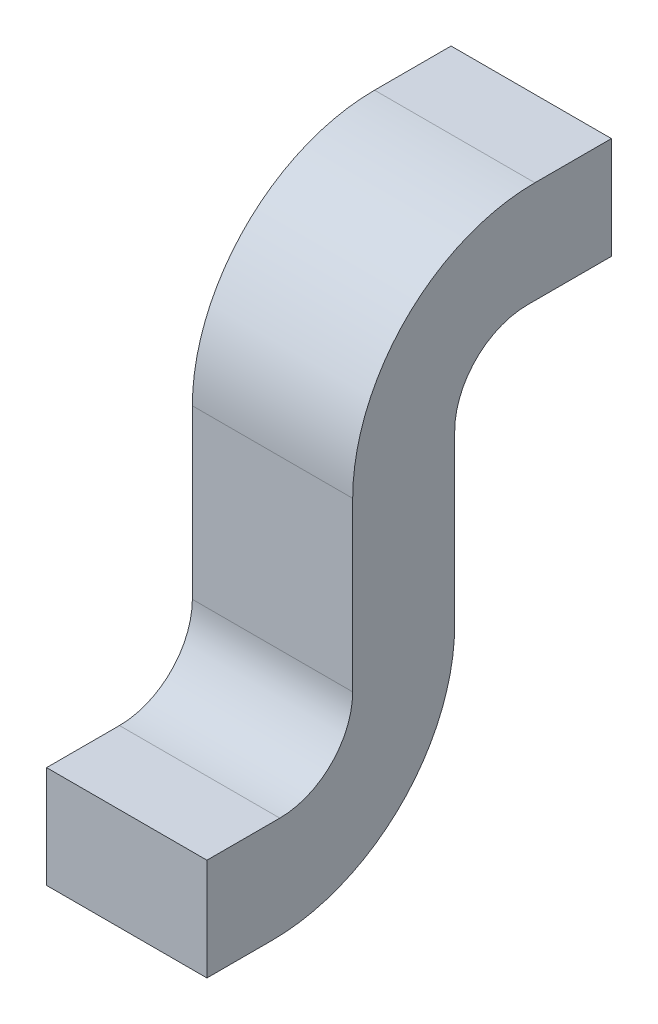
ISO-10303-21;
HEADER;
FILE_DESCRIPTION(('STEP AP214'),'2;1');
FILE_NAME('part.step','',(''),(''),'','','');
FILE_SCHEMA(('AUTOMOTIVE_DESIGN { 1 0 10303 214 1 1 1 1 }'));
ENDSEC;
DATA;
#1=APPLICATION_CONTEXT('core data for automotive mechanical design processes');
#2=APPLICATION_PROTOCOL_DEFINITION('international standard','automotive_design',2000,#1);
#3=PRODUCT_CONTEXT('',#1,'mechanical');
#4=PRODUCT('Part','Part','',(#3));
#5=PRODUCT_RELATED_PRODUCT_CATEGORY('part','',(#4));
#6=PRODUCT_DEFINITION_FORMATION('','',#4);
#7=PRODUCT_DEFINITION_CONTEXT('part definition',#1,'design');
#8=PRODUCT_DEFINITION('design','',#6,#7);
#9=PRODUCT_DEFINITION_SHAPE('','',#8);
#10=(LENGTH_UNIT() NAMED_UNIT(*) SI_UNIT(.MILLI.,.METRE.));
#11=(NAMED_UNIT(*) PLANE_ANGLE_UNIT() SI_UNIT($,.RADIAN.));
#12=(NAMED_UNIT(*) SI_UNIT($,.STERADIAN.) SOLID_ANGLE_UNIT());
#13=UNCERTAINTY_MEASURE_WITH_UNIT(LENGTH_MEASURE(1.E-05),#10,'distance_accuracy_value','');
#14=(GEOMETRIC_REPRESENTATION_CONTEXT(3) GLOBAL_UNCERTAINTY_ASSIGNED_CONTEXT((#13)) GLOBAL_UNIT_ASSIGNED_CONTEXT((#10,
#11,#12)) REPRESENTATION_CONTEXT('',''));
#15=CARTESIAN_POINT('',(0.,0.,0.));
#16=DIRECTION('',(0.,0.,1.));
#17=DIRECTION('',(1.,0.,0.));
#18=AXIS2_PLACEMENT_3D('',#15,#16,#17);
#19=CARTESIAN_POINT('',(0.11,0.165,0.545));
#20=DIRECTION('',(-1.,0.,0.));
#21=DIRECTION('',(0.,1.,0.));
#22=AXIS2_PLACEMENT_3D('',#19,#20,#21);
#23=PLANE('',#22);
#24=DIRECTION('',(0.,1.,0.));
#25=VECTOR('',#24,1.);
#26=CARTESIAN_POINT('',(0.11,0.165,1.1));
#27=LINE('',#26,#25);
#28=CARTESIAN_POINT('',(0.11,-0.485,1.1));
#29=VERTEX_POINT('',#28);
#30=CARTESIAN_POINT('',(0.11,-0.345,1.1));
#31=VERTEX_POINT('',#30);
#32=EDGE_CURVE('E215',#29,#31,#27,.T.);
#33=ORIENTED_EDGE('',*,*,#32,.F.);
#34=DIRECTION('',(0.,0.,1.));
#35=VECTOR('',#34,1.);
#36=CARTESIAN_POINT('',(0.11,-0.485,0.545));
#37=LINE('',#36,#35);
#38=CARTESIAN_POINT('',(0.11,-0.485,1.01));
#39=VERTEX_POINT('',#38);
#40=EDGE_CURVE('E189',#39,#29,#37,.T.);
#41=ORIENTED_EDGE('',*,*,#40,.F.);
#42=CARTESIAN_POINT('',(0.11,-0.235,1.01));
#43=DIRECTION('',(-1.,0.,0.));
#44=DIRECTION('',(0.,0.,1.));
#45=AXIS2_PLACEMENT_3D('',#42,#43,#44);
#46=CIRCLE('',#45,0.25);
#47=CARTESIAN_POINT('',(0.11,-0.235,0.76));
#48=VERTEX_POINT('',#47);
#49=EDGE_CURVE('E185',#48,#39,#46,.T.);
#50=ORIENTED_EDGE('',*,*,#49,.F.);
#51=DIRECTION('',(0.,-1.,0.));
#52=VECTOR('',#51,1.);
#53=CARTESIAN_POINT('',(0.11,0.165,0.76));
#54=LINE('',#53,#52);
#55=CARTESIAN_POINT('',(0.11,-0.004999999999999,0.76));
#56=VERTEX_POINT('',#55);
#57=EDGE_CURVE('E180',#56,#48,#54,.T.);
#58=ORIENTED_EDGE('',*,*,#57,.F.);
#59=CARTESIAN_POINT('',(0.11,-0.004999999999999,0.66));
#60=DIRECTION('',(1.,0.,0.));
#61=DIRECTION('',(0.,0.,1.));
#62=AXIS2_PLACEMENT_3D('',#59,#60,#61);
#63=CIRCLE('',#62,0.1);
#64=CARTESIAN_POINT('',(0.11,0.095,0.66));
#65=VERTEX_POINT('',#64);
#66=EDGE_CURVE('E142',#65,#56,#63,.T.);
#67=ORIENTED_EDGE('',*,*,#66,.F.);
#68=DIRECTION('',(0.,0.,1.));
#69=VECTOR('',#68,1.);
#70=CARTESIAN_POINT('',(0.11,0.095,0.545));
#71=LINE('',#70,#69);
#72=CARTESIAN_POINT('',(0.11,0.095,0.545));
#73=VERTEX_POINT('',#72);
#74=EDGE_CURVE('E138',#73,#65,#71,.T.);
#75=ORIENTED_EDGE('',*,*,#74,.F.);
#76=DIRECTION('',(0.,-1.,0.));
#77=VECTOR('',#76,1.);
#78=CARTESIAN_POINT('',(0.11,0.165,0.545));
#79=LINE('',#78,#77);
#80=CARTESIAN_POINT('',(0.11,0.235,0.545));
#81=VERTEX_POINT('',#80);
#82=EDGE_CURVE('E108',#81,#73,#79,.T.);
#83=ORIENTED_EDGE('',*,*,#82,.F.);
#84=DIRECTION('',(0.,0.,-1.));
#85=VECTOR('',#84,1.);
#86=CARTESIAN_POINT('',(0.11,0.235,0.545));
#87=LINE('',#86,#85);
#88=CARTESIAN_POINT('',(0.11,0.235,0.65));
#89=VERTEX_POINT('',#88);
#90=EDGE_CURVE('E99',#89,#81,#87,.T.);
#91=ORIENTED_EDGE('',*,*,#90,.F.);
#92=CARTESIAN_POINT('',(0.11,-0.015,0.65));
#93=DIRECTION('',(-1.,0.,0.));
#94=DIRECTION('',(0.,0.,1.));
#95=AXIS2_PLACEMENT_3D('',#92,#93,#94);
#96=CIRCLE('',#95,0.25);
#97=CARTESIAN_POINT('',(0.11,-0.015,0.9));
#98=VERTEX_POINT('',#97);
#99=EDGE_CURVE('E191',#98,#89,#96,.T.);
#100=ORIENTED_EDGE('',*,*,#99,.F.);
#101=DIRECTION('',(0.,1.,0.));
#102=VECTOR('',#101,1.);
#103=CARTESIAN_POINT('',(0.11,0.165,0.9));
#104=LINE('',#103,#102);
#105=CARTESIAN_POINT('',(0.11,-0.245,0.9));
#106=VERTEX_POINT('',#105);
#107=EDGE_CURVE('E205',#106,#98,#104,.T.);
#108=ORIENTED_EDGE('',*,*,#107,.F.);
#109=CARTESIAN_POINT('',(0.11,-0.245,1.));
#110=DIRECTION('',(1.,0.,0.));
#111=DIRECTION('',(0.,0.,1.));
#112=AXIS2_PLACEMENT_3D('',#109,#110,#111);
#113=CIRCLE('',#112,0.1);
#114=CARTESIAN_POINT('',(0.11,-0.345,1.));
#115=VERTEX_POINT('',#114);
#116=EDGE_CURVE('E172',#115,#106,#113,.T.);
#117=ORIENTED_EDGE('',*,*,#116,.F.);
#118=DIRECTION('',(0.,0.,-1.));
#119=VECTOR('',#118,1.);
#120=CARTESIAN_POINT('',(0.11,-0.345,0.545));
#121=LINE('',#120,#119);
#122=EDGE_CURVE('E11',#31,#115,#121,.T.);
#123=ORIENTED_EDGE('',*,*,#122,.F.);
#124=EDGE_LOOP('',(#33,#41,#50,#58,#67,#75,#83,#91,#100,#108,#117,#123));
#125=FACE_BOUND('',#124,.T.);
#126=ADVANCED_FACE('F16',(#125),#23,.F.);
#127=CARTESIAN_POINT('',(-0.11,-0.345,1.05));
#128=DIRECTION('',(0.,1.,0.));
#129=DIRECTION('',(0.,0.,-1.));
#130=AXIS2_PLACEMENT_3D('',#127,#128,#129);
#131=PLANE('',#130);
#132=DIRECTION('',(0.,0.,1.));
#133=VECTOR('',#132,1.);
#134=CARTESIAN_POINT('',(-0.11,-0.345,1.05));
#135=LINE('',#134,#133);
#136=CARTESIAN_POINT('',(-0.11,-0.345,1.));
#137=VERTEX_POINT('',#136);
#138=CARTESIAN_POINT('',(-0.11,-0.345,1.1));
#139=VERTEX_POINT('',#138);
#140=EDGE_CURVE('E20',#137,#139,#135,.T.);
#141=ORIENTED_EDGE('',*,*,#140,.T.);
#142=DIRECTION('',(1.,0.,0.));
#143=VECTOR('',#142,1.);
#144=CARTESIAN_POINT('',(-0.11,-0.345,1.1));
#145=LINE('',#144,#143);
#146=EDGE_CURVE('E27',#139,#31,#145,.T.);
#147=ORIENTED_EDGE('',*,*,#146,.T.);
#148=ORIENTED_EDGE('',*,*,#122,.T.);
#149=DIRECTION('',(-1.,0.,0.));
#150=VECTOR('',#149,1.);
#151=CARTESIAN_POINT('',(-0.11,-0.345,1.));
#152=LINE('',#151,#150);
#153=EDGE_CURVE('E176',#115,#137,#152,.T.);
#154=ORIENTED_EDGE('',*,*,#153,.T.);
#155=EDGE_LOOP('',(#141,#147,#148,#154));
#156=FACE_BOUND('',#155,.T.);
#157=ADVANCED_FACE('F429',(#156),#131,.T.);
#158=CARTESIAN_POINT('',(-0.11,-0.415,1.1));
#159=DIRECTION('',(0.,0.,1.));
#160=DIRECTION('',(1.,0.,0.));
#161=AXIS2_PLACEMENT_3D('',#158,#159,#160);
#162=PLANE('',#161);
#163=DIRECTION('',(0.,-1.,0.));
#164=VECTOR('',#163,1.);
#165=CARTESIAN_POINT('',(-0.11,-0.415,1.1));
#166=LINE('',#165,#164);
#167=CARTESIAN_POINT('',(-0.11,-0.485,1.1));
#168=VERTEX_POINT('',#167);
#169=EDGE_CURVE('E240',#139,#168,#166,.T.);
#170=ORIENTED_EDGE('',*,*,#169,.T.);
#171=DIRECTION('',(1.,0.,0.));
#172=VECTOR('',#171,1.);
#173=CARTESIAN_POINT('',(-0.11,-0.485,1.1));
#174=LINE('',#173,#172);
#175=EDGE_CURVE('E200',#168,#29,#174,.T.);
#176=ORIENTED_EDGE('',*,*,#175,.T.);
#177=ORIENTED_EDGE('',*,*,#32,.T.);
#178=ORIENTED_EDGE('',*,*,#146,.F.);
#179=EDGE_LOOP('',(#170,#176,#177,#178));
#180=FACE_BOUND('',#179,.T.);
#181=ADVANCED_FACE('F262',(#180),#162,.T.);
#182=CARTESIAN_POINT('',(-0.11,-0.485,1.055));
#183=DIRECTION('',(0.,-1.,0.));
#184=DIRECTION('',(0.,0.,-1.));
#185=AXIS2_PLACEMENT_3D('',#182,#183,#184);
#186=PLANE('',#185);
#187=DIRECTION('',(0.,0.,-1.));
#188=VECTOR('',#187,1.);
#189=CARTESIAN_POINT('',(-0.11,-0.485,1.055));
#190=LINE('',#189,#188);
#191=CARTESIAN_POINT('',(-0.11,-0.485,1.01));
#192=VERTEX_POINT('',#191);
#193=EDGE_CURVE('E236',#168,#192,#190,.T.);
#194=ORIENTED_EDGE('',*,*,#193,.T.);
#195=DIRECTION('',(1.,0.,0.));
#196=VECTOR('',#195,1.);
#197=CARTESIAN_POINT('',(-0.11,-0.485,1.01));
#198=LINE('',#197,#196);
#199=EDGE_CURVE('E190',#192,#39,#198,.T.);
#200=ORIENTED_EDGE('',*,*,#199,.T.);
#201=ORIENTED_EDGE('',*,*,#40,.T.);
#202=ORIENTED_EDGE('',*,*,#175,.F.);
#203=EDGE_LOOP('',(#194,#200,#201,#202));
#204=FACE_BOUND('',#203,.T.);
#205=ADVANCED_FACE('F268',(#204),#186,.T.);
#206=CARTESIAN_POINT('',(-0.11,-0.235,1.01));
#207=DIRECTION('',(-1.,0.,0.));
#208=DIRECTION('',(0.,0.,1.));
#209=AXIS2_PLACEMENT_3D('',#206,#207,#208);
#210=CYLINDRICAL_SURFACE('',#209,0.25);
#211=ORIENTED_EDGE('',*,*,#199,.F.);
#212=CARTESIAN_POINT('',(-0.11,-0.235,1.01));
#213=DIRECTION('',(1.,0.,0.));
#214=DIRECTION('',(0.,0.,1.));
#215=AXIS2_PLACEMENT_3D('',#212,#213,#214);
#216=CIRCLE('',#215,0.25);
#217=CARTESIAN_POINT('',(-0.11,-0.235,0.76));
#218=VERTEX_POINT('',#217);
#219=EDGE_CURVE('E241',#192,#218,#216,.T.);
#220=ORIENTED_EDGE('',*,*,#219,.T.);
#221=DIRECTION('',(1.,0.,0.));
#222=VECTOR('',#221,1.);
#223=CARTESIAN_POINT('',(-0.11,-0.235,0.76));
#224=LINE('',#223,#222);
#225=EDGE_CURVE('E183',#218,#48,#224,.T.);
#226=ORIENTED_EDGE('',*,*,#225,.T.);
#227=ORIENTED_EDGE('',*,*,#49,.T.);
#228=EDGE_LOOP('',(#211,#220,#226,#227));
#229=FACE_BOUND('',#228,.T.);
#230=ADVANCED_FACE('F18',(#229),#210,.T.);
#231=CARTESIAN_POINT('',(-0.11,-0.12,0.76));
#232=DIRECTION('',(0.,0.,-1.));
#233=DIRECTION('',(-1.,0.,0.));
#234=AXIS2_PLACEMENT_3D('',#231,#232,#233);
#235=PLANE('',#234);
#236=DIRECTION('',(0.,1.,0.));
#237=VECTOR('',#236,1.);
#238=CARTESIAN_POINT('',(-0.11,-0.12,0.76));
#239=LINE('',#238,#237);
#240=CARTESIAN_POINT('',(-0.11,-0.004999999999999,0.76));
#241=VERTEX_POINT('',#240);
#242=EDGE_CURVE('E153',#218,#241,#239,.T.);
#243=ORIENTED_EDGE('',*,*,#242,.T.);
#244=DIRECTION('',(1.,0.,0.));
#245=VECTOR('',#244,1.);
#246=CARTESIAN_POINT('',(-0.11,-0.004999999999998,0.76));
#247=LINE('',#246,#245);
#248=EDGE_CURVE('E148',#241,#56,#247,.T.);
#249=ORIENTED_EDGE('',*,*,#248,.T.);
#250=ORIENTED_EDGE('',*,*,#57,.T.);
#251=ORIENTED_EDGE('',*,*,#225,.F.);
#252=EDGE_LOOP('',(#243,#249,#250,#251));
#253=FACE_BOUND('',#252,.T.);
#254=ADVANCED_FACE('F503',(#253),#235,.T.);
#255=CARTESIAN_POINT('',(-0.11,-0.004999999999999,0.66));
#256=DIRECTION('',(-1.,0.,0.));
#257=DIRECTION('',(0.,0.,1.));
#258=AXIS2_PLACEMENT_3D('',#255,#256,#257);
#259=CYLINDRICAL_SURFACE('',#258,0.1);
#260=DIRECTION('',(-1.,0.,0.));
#261=VECTOR('',#260,1.);
#262=CARTESIAN_POINT('',(-0.11,0.095,0.66));
#263=LINE('',#262,#261);
#264=CARTESIAN_POINT('',(-0.11,0.095,0.66));
#265=VERTEX_POINT('',#264);
#266=EDGE_CURVE('E131',#65,#265,#263,.T.);
#267=ORIENTED_EDGE('',*,*,#266,.F.);
#268=ORIENTED_EDGE('',*,*,#66,.T.);
#269=ORIENTED_EDGE('',*,*,#248,.F.);
#270=CARTESIAN_POINT('',(-0.11,-0.004999999999999,0.66));
#271=DIRECTION('',(1.,0.,0.));
#272=DIRECTION('',(0.,0.,1.));
#273=AXIS2_PLACEMENT_3D('',#270,#271,#272);
#274=CIRCLE('',#273,0.1);
#275=EDGE_CURVE('E145',#265,#241,#274,.T.);
#276=ORIENTED_EDGE('',*,*,#275,.F.);
#277=EDGE_LOOP('',(#267,#268,#269,#276));
#278=FACE_BOUND('',#277,.T.);
#279=ADVANCED_FACE('F146',(#278),#259,.F.);
#280=CARTESIAN_POINT('',(-0.11,0.095,0.6025));
#281=DIRECTION('',(0.,-1.,0.));
#282=DIRECTION('',(0.,0.,-1.));
#283=AXIS2_PLACEMENT_3D('',#280,#281,#282);
#284=PLANE('',#283);
#285=DIRECTION('',(0.,0.,-1.));
#286=VECTOR('',#285,1.);
#287=CARTESIAN_POINT('',(-0.11,0.095,0.6025));
#288=LINE('',#287,#286);
#289=CARTESIAN_POINT('',(-0.11,0.095,0.545));
#290=VERTEX_POINT('',#289);
#291=EDGE_CURVE('E136',#265,#290,#288,.T.);
#292=ORIENTED_EDGE('',*,*,#291,.T.);
#293=DIRECTION('',(1.,0.,0.));
#294=VECTOR('',#293,1.);
#295=CARTESIAN_POINT('',(-0.11,0.095,0.545));
#296=LINE('',#295,#294);
#297=EDGE_CURVE('E170',#290,#73,#296,.T.);
#298=ORIENTED_EDGE('',*,*,#297,.T.);
#299=ORIENTED_EDGE('',*,*,#74,.T.);
#300=ORIENTED_EDGE('',*,*,#266,.T.);
#301=EDGE_LOOP('',(#292,#298,#299,#300));
#302=FACE_BOUND('',#301,.T.);
#303=ADVANCED_FACE('F133',(#302),#284,.T.);
#304=CARTESIAN_POINT('',(-0.11,0.165,0.545));
#305=DIRECTION('',(0.,0.,-1.));
#306=DIRECTION('',(-1.,0.,0.));
#307=AXIS2_PLACEMENT_3D('',#304,#305,#306);
#308=PLANE('',#307);
#309=DIRECTION('',(0.,1.,0.));
#310=VECTOR('',#309,1.);
#311=CARTESIAN_POINT('',(-0.11,0.165,0.545));
#312=LINE('',#311,#310);
#313=CARTESIAN_POINT('',(-0.11,0.235,0.545));
#314=VERTEX_POINT('',#313);
#315=EDGE_CURVE('E159',#290,#314,#312,.T.);
#316=ORIENTED_EDGE('',*,*,#315,.T.);
#317=DIRECTION('',(1.,0.,0.));
#318=VECTOR('',#317,1.);
#319=CARTESIAN_POINT('',(-0.11,0.235,0.545));
#320=LINE('',#319,#318);
#321=EDGE_CURVE('E206',#314,#81,#320,.T.);
#322=ORIENTED_EDGE('',*,*,#321,.T.);
#323=ORIENTED_EDGE('',*,*,#82,.T.);
#324=ORIENTED_EDGE('',*,*,#297,.F.);
#325=EDGE_LOOP('',(#316,#322,#323,#324));
#326=FACE_BOUND('',#325,.T.);
#327=ADVANCED_FACE('F283',(#326),#308,.T.);
#328=CARTESIAN_POINT('',(-0.11,0.235,0.5975));
#329=DIRECTION('',(0.,1.,0.));
#330=DIRECTION('',(1.,0.,0.));
#331=AXIS2_PLACEMENT_3D('',#328,#329,#330);
#332=PLANE('',#331);
#333=DIRECTION('',(0.,0.,1.));
#334=VECTOR('',#333,1.);
#335=CARTESIAN_POINT('',(-0.11,0.235,0.5975));
#336=LINE('',#335,#334);
#337=CARTESIAN_POINT('',(-0.11,0.235,0.65));
#338=VERTEX_POINT('',#337);
#339=EDGE_CURVE('E166',#314,#338,#336,.T.);
#340=ORIENTED_EDGE('',*,*,#339,.T.);
#341=DIRECTION('',(1.,0.,0.));
#342=VECTOR('',#341,1.);
#343=CARTESIAN_POINT('',(-0.11,0.235,0.65));
#344=LINE('',#343,#342);
#345=EDGE_CURVE('E194',#338,#89,#344,.T.);
#346=ORIENTED_EDGE('',*,*,#345,.T.);
#347=ORIENTED_EDGE('',*,*,#90,.T.);
#348=ORIENTED_EDGE('',*,*,#321,.F.);
#349=EDGE_LOOP('',(#340,#346,#347,#348));
#350=FACE_BOUND('',#349,.T.);
#351=ADVANCED_FACE('F280',(#350),#332,.T.);
#352=CARTESIAN_POINT('',(-0.11,-0.015,0.65));
#353=DIRECTION('',(-1.,0.,0.));
#354=DIRECTION('',(0.,0.,1.));
#355=AXIS2_PLACEMENT_3D('',#352,#353,#354);
#356=CYLINDRICAL_SURFACE('',#355,0.25);
#357=ORIENTED_EDGE('',*,*,#345,.F.);
#358=CARTESIAN_POINT('',(-0.11,-0.015,0.65));
#359=DIRECTION('',(1.,0.,0.));
#360=DIRECTION('',(0.,0.,1.));
#361=AXIS2_PLACEMENT_3D('',#358,#359,#360);
#362=CIRCLE('',#361,0.25);
#363=CARTESIAN_POINT('',(-0.11,-0.015,0.9));
#364=VERTEX_POINT('',#363);
#365=EDGE_CURVE('E221',#338,#364,#362,.T.);
#366=ORIENTED_EDGE('',*,*,#365,.T.);
#367=DIRECTION('',(1.,0.,0.));
#368=VECTOR('',#367,1.);
#369=CARTESIAN_POINT('',(-0.11,-0.015,0.9));
#370=LINE('',#369,#368);
#371=EDGE_CURVE('E201',#364,#98,#370,.T.);
#372=ORIENTED_EDGE('',*,*,#371,.T.);
#373=ORIENTED_EDGE('',*,*,#99,.T.);
#374=EDGE_LOOP('',(#357,#366,#372,#373));
#375=FACE_BOUND('',#374,.T.);
#376=ADVANCED_FACE('F398',(#375),#356,.T.);
#377=CARTESIAN_POINT('',(-0.11,-0.13,0.9));
#378=DIRECTION('',(0.,0.,1.));
#379=DIRECTION('',(1.,0.,0.));
#380=AXIS2_PLACEMENT_3D('',#377,#378,#379);
#381=PLANE('',#380);
#382=DIRECTION('',(0.,-1.,0.));
#383=VECTOR('',#382,1.);
#384=CARTESIAN_POINT('',(-0.11,-0.13,0.9));
#385=LINE('',#384,#383);
#386=CARTESIAN_POINT('',(-0.11,-0.245,0.9));
#387=VERTEX_POINT('',#386);
#388=EDGE_CURVE('E225',#364,#387,#385,.T.);
#389=ORIENTED_EDGE('',*,*,#388,.T.);
#390=DIRECTION('',(1.,0.,0.));
#391=VECTOR('',#390,1.);
#392=CARTESIAN_POINT('',(-0.11,-0.245,0.9));
#393=LINE('',#392,#391);
#394=EDGE_CURVE('E175',#387,#106,#393,.T.);
#395=ORIENTED_EDGE('',*,*,#394,.T.);
#396=ORIENTED_EDGE('',*,*,#107,.T.);
#397=ORIENTED_EDGE('',*,*,#371,.F.);
#398=EDGE_LOOP('',(#389,#395,#396,#397));
#399=FACE_BOUND('',#398,.T.);
#400=ADVANCED_FACE('F404',(#399),#381,.T.);
#401=CARTESIAN_POINT('',(-0.11,-0.245,1.));
#402=DIRECTION('',(-1.,0.,0.));
#403=DIRECTION('',(0.,0.,1.));
#404=AXIS2_PLACEMENT_3D('',#401,#402,#403);
#405=CYLINDRICAL_SURFACE('',#404,0.1);
#406=ORIENTED_EDGE('',*,*,#153,.F.);
#407=ORIENTED_EDGE('',*,*,#116,.T.);
#408=ORIENTED_EDGE('',*,*,#394,.F.);
#409=CARTESIAN_POINT('',(-0.11,-0.245,1.));
#410=DIRECTION('',(1.,0.,0.));
#411=DIRECTION('',(0.,0.,1.));
#412=AXIS2_PLACEMENT_3D('',#409,#410,#411);
#413=CIRCLE('',#412,0.1);
#414=EDGE_CURVE('E248',#137,#387,#413,.T.);
#415=ORIENTED_EDGE('',*,*,#414,.F.);
#416=EDGE_LOOP('',(#406,#407,#408,#415));
#417=FACE_BOUND('',#416,.T.);
#418=ADVANCED_FACE('F447',(#417),#405,.F.);
#419=CARTESIAN_POINT('',(-0.11,-0.121132572617,0.825365755119));
#420=DIRECTION('',(-1.,0.,0.));
#421=DIRECTION('',(0.,1.,0.));
#422=AXIS2_PLACEMENT_3D('',#419,#420,#421);
#423=PLANE('',#422);
#424=ORIENTED_EDGE('',*,*,#219,.F.);
#425=ORIENTED_EDGE('',*,*,#193,.F.);
#426=ORIENTED_EDGE('',*,*,#169,.F.);
#427=ORIENTED_EDGE('',*,*,#140,.F.);
#428=ORIENTED_EDGE('',*,*,#414,.T.);
#429=ORIENTED_EDGE('',*,*,#388,.F.);
#430=ORIENTED_EDGE('',*,*,#365,.F.);
#431=ORIENTED_EDGE('',*,*,#339,.F.);
#432=ORIENTED_EDGE('',*,*,#315,.F.);
#433=ORIENTED_EDGE('',*,*,#291,.F.);
#434=ORIENTED_EDGE('',*,*,#275,.T.);
#435=ORIENTED_EDGE('',*,*,#242,.F.);
#436=EDGE_LOOP('',(#424,#425,#426,#427,#428,#429,#430,#431,#432,#433,#434,#435));
#437=FACE_BOUND('',#436,.T.);
#438=ADVANCED_FACE('F156',(#437),#423,.T.);
#439=CLOSED_SHELL('',(#126,#157,#181,#205,#230,#254,#279,#303,#327,#351,#376,#400,#418,#438));
#440=MANIFOLD_SOLID_BREP('B1',#439);
#441=ADVANCED_BREP_SHAPE_REPRESENTATION('',(#18,#440),#14);
#442=SHAPE_DEFINITION_REPRESENTATION(#9,#441);
ENDSEC;
END-ISO-10303-21;
